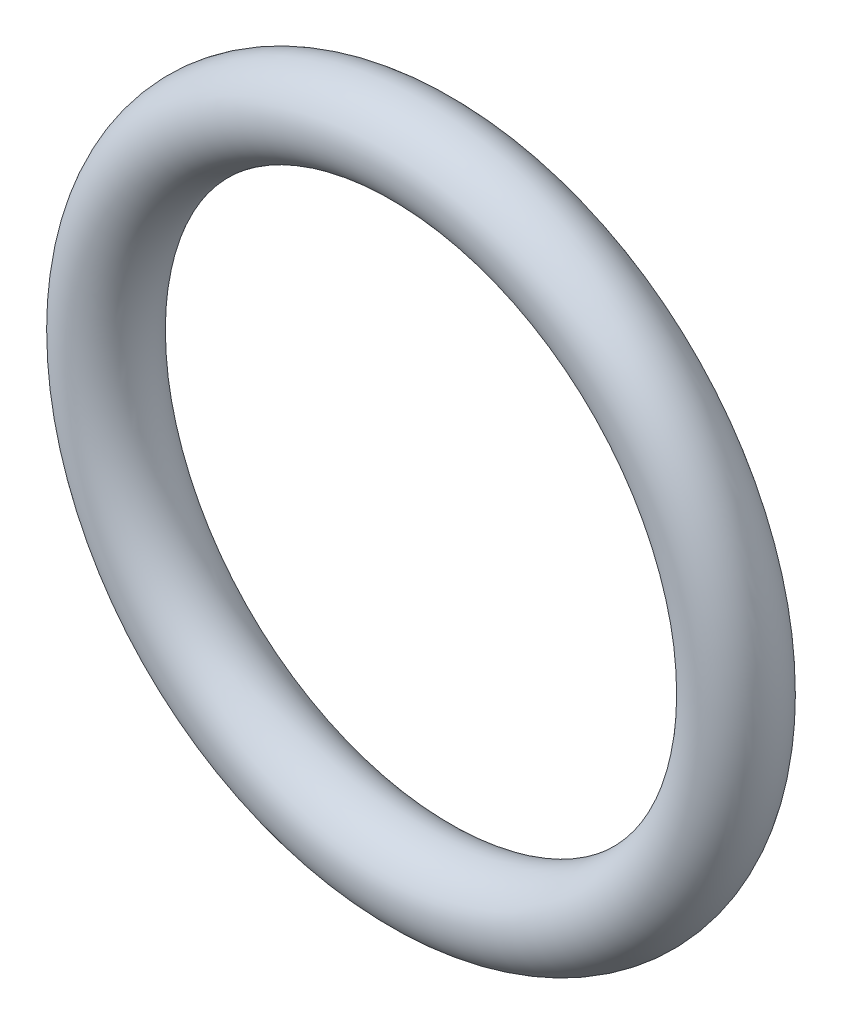
ISO-10303-21;
HEADER;
FILE_DESCRIPTION(('STEP AP214'),'2;1');
FILE_NAME('part.step','',(''),(''),'','','');
FILE_SCHEMA(('AUTOMOTIVE_DESIGN { 1 0 10303 214 1 1 1 1 }'));
ENDSEC;
DATA;
#1=APPLICATION_CONTEXT('core data for automotive mechanical design processes');
#2=APPLICATION_PROTOCOL_DEFINITION('international standard','automotive_design',2000,#1);
#3=PRODUCT_CONTEXT('',#1,'mechanical');
#4=PRODUCT('Part','Part','',(#3));
#5=PRODUCT_RELATED_PRODUCT_CATEGORY('part','',(#4));
#6=PRODUCT_DEFINITION_FORMATION('','',#4);
#7=PRODUCT_DEFINITION_CONTEXT('part definition',#1,'design');
#8=PRODUCT_DEFINITION('design','',#6,#7);
#9=PRODUCT_DEFINITION_SHAPE('','',#8);
#10=(LENGTH_UNIT() NAMED_UNIT(*) SI_UNIT(.MILLI.,.METRE.));
#11=(NAMED_UNIT(*) PLANE_ANGLE_UNIT() SI_UNIT($,.RADIAN.));
#12=(NAMED_UNIT(*) SI_UNIT($,.STERADIAN.) SOLID_ANGLE_UNIT());
#13=UNCERTAINTY_MEASURE_WITH_UNIT(LENGTH_MEASURE(1.E-05),#10,'distance_accuracy_value','');
#14=(GEOMETRIC_REPRESENTATION_CONTEXT(3) GLOBAL_UNCERTAINTY_ASSIGNED_CONTEXT((#13)) GLOBAL_UNIT_ASSIGNED_CONTEXT((#10,
#11,#12)) REPRESENTATION_CONTEXT('',''));
#15=CARTESIAN_POINT('',(0.,0.,0.));
#16=DIRECTION('',(0.,0.,1.));
#17=DIRECTION('',(1.,0.,0.));
#18=AXIS2_PLACEMENT_3D('',#15,#16,#17);
#19=CARTESIAN_POINT('',(0.,0.,0.));
#20=DIRECTION('',(0.,0.,-1.));
#21=DIRECTION('',(-1.,0.,0.));
#22=AXIS2_PLACEMENT_3D('',#19,#20,#21);
#23=TOROIDAL_SURFACE('',#22,3.75,0.500000000000001);
#24=CARTESIAN_POINT('',(-4.25,0.,0.));
#25=VERTEX_POINT('',#24);
#26=VERTEX_LOOP('',#25);
#27=FACE_BOUND('',#26,.T.);
#28=ADVANCED_FACE('F37',(#27),#23,.T.);
#29=CLOSED_SHELL('',(#28));
#30=MANIFOLD_SOLID_BREP('B2',#29);
#31=ADVANCED_BREP_SHAPE_REPRESENTATION('',(#18,#30),#14);
#32=SHAPE_DEFINITION_REPRESENTATION(#9,#31);
ENDSEC;
END-ISO-10303-21;
